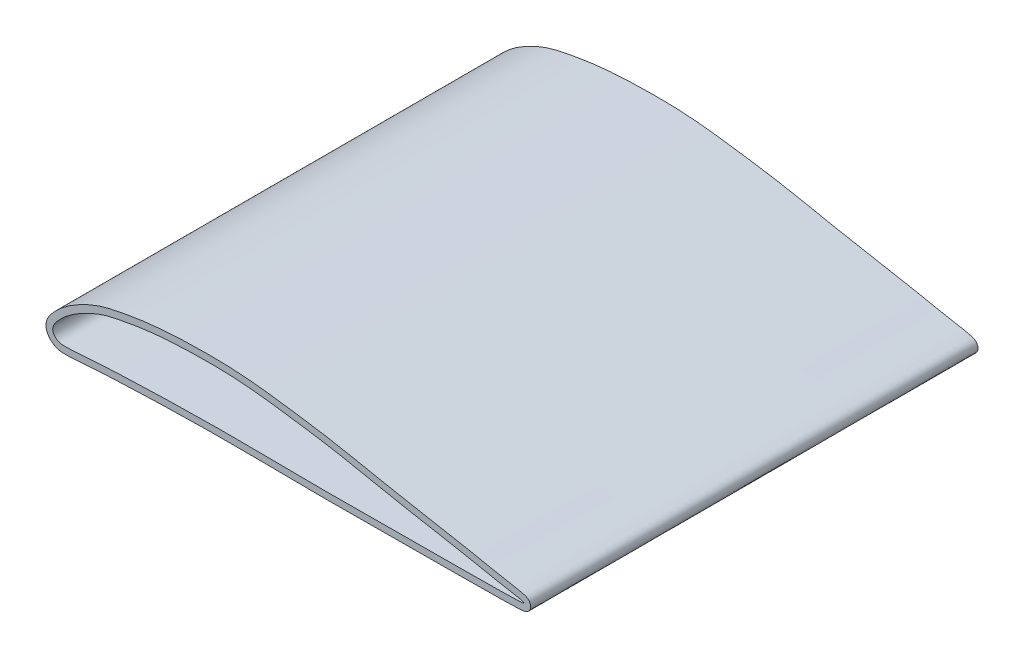
ISO-10303-21;
HEADER;
FILE_DESCRIPTION(('STEP AP214'),'2;1');
FILE_NAME('part.step','',(''),(''),'','','');
FILE_SCHEMA(('AUTOMOTIVE_DESIGN { 1 0 10303 214 1 1 1 1 }'));
ENDSEC;
DATA;
#1=APPLICATION_CONTEXT('core data for automotive mechanical design processes');
#2=APPLICATION_PROTOCOL_DEFINITION('international standard','automotive_design',2000,#1);
#3=PRODUCT_CONTEXT('',#1,'mechanical');
#4=PRODUCT('Part','Part','',(#3));
#5=PRODUCT_RELATED_PRODUCT_CATEGORY('part','',(#4));
#6=PRODUCT_DEFINITION_FORMATION('','',#4);
#7=PRODUCT_DEFINITION_CONTEXT('part definition',#1,'design');
#8=PRODUCT_DEFINITION('design','',#6,#7);
#9=PRODUCT_DEFINITION_SHAPE('','',#8);
#10=(LENGTH_UNIT() NAMED_UNIT(*) SI_UNIT(.MILLI.,.METRE.));
#11=(NAMED_UNIT(*) PLANE_ANGLE_UNIT() SI_UNIT($,.RADIAN.));
#12=(NAMED_UNIT(*) SI_UNIT($,.STERADIAN.) SOLID_ANGLE_UNIT());
#13=UNCERTAINTY_MEASURE_WITH_UNIT(LENGTH_MEASURE(1.E-05),#10,'distance_accuracy_value','');
#14=(GEOMETRIC_REPRESENTATION_CONTEXT(3) GLOBAL_UNCERTAINTY_ASSIGNED_CONTEXT((#13)) GLOBAL_UNIT_ASSIGNED_CONTEXT((#10,
#11,#12)) REPRESENTATION_CONTEXT('',''));
#15=CARTESIAN_POINT('',(0.,0.,0.));
#16=DIRECTION('',(0.,0.,1.));
#17=DIRECTION('',(1.,0.,0.));
#18=AXIS2_PLACEMENT_3D('',#15,#16,#17);
#19=CARTESIAN_POINT('',(-2.12770220526425,9.28546322944858,337.82));
#20=DIRECTION('',(0.,0.,-1.));
#21=DIRECTION('',(-1.,0.,0.));
#22=AXIS2_PLACEMENT_3D('',#19,#20,#21);
#23=PLANE('',#22);
#24=CARTESIAN_POINT('',(360.611783088414,-0.829716984691534,337.82));
#25=CARTESIAN_POINT('',(360.677516736931,-0.431769590755068,337.82));
#26=CARTESIAN_POINT('',(360.715012102294,0.39737776358076,337.82));
#27=CARTESIAN_POINT('',(360.421664380915,1.89734659052009,337.82));
#28=CARTESIAN_POINT('',(359.690517844514,3.17401205027613,337.82));
#29=CARTESIAN_POINT('',(358.918126768744,3.96508175282873,337.82));
#30=CARTESIAN_POINT('',(358.318267032827,4.42066290293129,337.82));
#31=CARTESIAN_POINT('',(357.843135950298,4.70927198930258,337.82));
#32=CARTESIAN_POINT('',(357.314769247348,4.98094514254315,337.82));
#33=CARTESIAN_POINT('',(356.769061674902,5.20760724953017,337.82));
#34=CARTESIAN_POINT('',(356.166361832082,5.41896649450408,337.82));
#35=CARTESIAN_POINT('',(355.564871973001,5.60295091670029,337.82));
#36=CARTESIAN_POINT('',(354.940172054753,5.77519661899665,337.82));
#37=CARTESIAN_POINT('',(354.062218077521,5.99777597210625,337.82));
#38=CARTESIAN_POINT('',(352.868144290553,6.27164418057462,337.82));
#39=CARTESIAN_POINT('',(351.281150812052,6.60345342509342,337.82));
#40=CARTESIAN_POINT('',(349.562200998619,6.93999659218324,337.82));
#41=CARTESIAN_POINT('',(347.7407484887,7.2805028361551,337.82));
#42=CARTESIAN_POINT('',(345.849846535147,7.62302316120932,337.82));
#43=CARTESIAN_POINT('',(343.284754246802,8.07888802212605,337.82));
#44=CARTESIAN_POINT('',(340.077278886889,8.64115010600491,337.82));
#45=CARTESIAN_POINT('',(336.581931789645,9.27338582575616,337.82));
#46=CARTESIAN_POINT('',(332.422020488974,10.0640645410946,337.82));
#47=CARTESIAN_POINT('',(327.903122178561,10.9777528968965,337.82));
#48=CARTESIAN_POINT('',(322.976471656021,12.0169837915886,337.82));
#49=CARTESIAN_POINT('',(317.864518336372,13.0643737721078,337.82));
#50=CARTESIAN_POINT('',(312.471448603847,14.1199230530068,337.82));
#51=CARTESIAN_POINT('',(306.892602428793,15.1792404595878,337.82));
#52=CARTESIAN_POINT('',(299.271359613369,16.5928128056946,337.82));
#53=CARTESIAN_POINT('',(289.539235870043,18.3555767649719,337.82));
#54=CARTESIAN_POINT('',(278.069145873182,20.4269138910801,337.82));
#55=CARTESIAN_POINT('',(266.889028325214,22.4813885575546,337.82));
#56=CARTESIAN_POINT('',(255.836169363417,24.5743857296795,337.82));
#57=CARTESIAN_POINT('',(241.119161142244,27.5041516765873,337.82));
#58=CARTESIAN_POINT('',(226.17771818306,30.6284955585057,337.82));
#59=CARTESIAN_POINT('',(211.073246752962,33.4503768288242,337.82));
#60=CARTESIAN_POINT('',(195.957402496639,35.9498185763177,337.82));
#61=CARTESIAN_POINT('',(177.127921344669,38.6597453231217,337.82));
#62=CARTESIAN_POINT('',(158.171643384304,41.2095808677918,337.82));
#63=CARTESIAN_POINT('',(142.799977726278,42.6172304733267,337.82));
#64=CARTESIAN_POINT('',(127.3617538442,43.4085128169304,337.82));
#65=CARTESIAN_POINT('',(111.9803158707,43.4046138855933,337.82));
#66=CARTESIAN_POINT('',(96.6348267084863,42.956517857911,337.82));
#67=CARTESIAN_POINT('',(85.0848707586515,42.3205909914167,337.82));
#68=CARTESIAN_POINT('',(73.531301514642,41.2765470192465,337.82));
#69=CARTESIAN_POINT('',(63.9313400403143,39.958908520291,337.82));
#70=CARTESIAN_POINT('',(56.3171155845465,38.6791030971168,337.82));
#71=CARTESIAN_POINT('',(50.6499497599874,37.6425202662996,337.82));
#72=CARTESIAN_POINT('',(44.9021633114431,36.4945120368245,337.82));
#73=CARTESIAN_POINT('',(39.1082915605699,35.0915992380378,337.82));
#74=CARTESIAN_POINT('',(33.2849324709737,33.2881291630142,337.82));
#75=CARTESIAN_POINT('',(27.6295600534796,30.9904600469647,337.82));
#76=CARTESIAN_POINT('',(22.2804118646765,28.4439820560217,337.82));
#77=CARTESIAN_POINT('',(17.0046326392783,25.6141861462535,337.82));
#78=CARTESIAN_POINT('',(11.8148958602526,22.3569422918749,337.82));
#79=CARTESIAN_POINT('',(7.67976623012431,19.2848085907363,337.82));
#80=CARTESIAN_POINT('',(4.59692601950477,16.635405025183,337.82));
#81=CARTESIAN_POINT('',(2.75896588536493,14.8760894966245,337.82));
#82=CARTESIAN_POINT('',(1.29550753139356,13.3542887541975,337.82));
#83=CARTESIAN_POINT('',(-0.163888759750838,11.7621121392498,337.82));
#84=CARTESIAN_POINT('',(-1.76422697415687,9.87346266874208,337.82));
#85=CARTESIAN_POINT('',(-3.25473722108047,7.6373019832347,337.82));
#86=CARTESIAN_POINT('',(-4.24628459349043,5.73495661624964,337.82));
#87=CARTESIAN_POINT('',(-5.00239928749968,3.53636937217703,337.82));
#88=CARTESIAN_POINT('',(-5.26736052713064,1.40326338643544,337.82));
#89=CARTESIAN_POINT('',(-5.12293710295604,-0.423499273381427,337.82));
#90=CARTESIAN_POINT('',(-4.69457004507471,-2.28179932337742,337.82));
#91=CARTESIAN_POINT('',(-3.75857745264617,-4.27625739479231,337.82));
#92=CARTESIAN_POINT('',(-2.25734351985861,-6.25985534644904,337.82));
#93=CARTESIAN_POINT('',(-0.464391315841216,-7.89542098064643,337.82));
#94=CARTESIAN_POINT('',(1.57959188809487,-9.2065616818801,337.82));
#95=CARTESIAN_POINT('',(3.94550239027525,-10.1218160695568,337.82));
#96=CARTESIAN_POINT('',(6.09493637855499,-10.5121842637663,337.82));
#97=CARTESIAN_POINT('',(7.97730648609706,-10.635362611475,337.82));
#98=CARTESIAN_POINT('',(9.51378006784479,-10.6559856217739,337.82));
#99=CARTESIAN_POINT('',(11.0416365883093,-10.6551970821441,337.82));
#100=CARTESIAN_POINT('',(12.5521230776529,-10.6243070079716,337.82));
#101=CARTESIAN_POINT('',(14.5465880708117,-10.5534600115824,337.82));
#102=CARTESIAN_POINT('',(17.0027877836702,-10.4174453262564,337.82));
#103=CARTESIAN_POINT('',(19.8949796055631,-10.2135180018431,337.82));
#104=CARTESIAN_POINT('',(22.7646933158898,-9.98881693717707,337.82));
#105=CARTESIAN_POINT('',(26.5530442008788,-9.67955193951272,337.82));
#106=CARTESIAN_POINT('',(31.2339877004447,-9.32155039401743,337.82));
#107=CARTESIAN_POINT('',(36.8687596815271,-8.95415187691269,337.82));
#108=CARTESIAN_POINT('',(42.5127093096359,-8.64234179615913,337.82));
#109=CARTESIAN_POINT('',(50.0612723083799,-8.28265032401868,337.82));
#110=CARTESIAN_POINT('',(59.5358879153629,-7.89049896565152,337.82));
#111=CARTESIAN_POINT('',(70.8921113057371,-7.47157703221145,337.82));
#112=CARTESIAN_POINT('',(82.2509482839475,-7.13095886237088,337.82));
#113=CARTESIAN_POINT('',(93.6164314430209,-6.85714543292889,337.82));
#114=CARTESIAN_POINT('',(108.778159596147,-6.57307460139264,337.82));
#115=CARTESIAN_POINT('',(127.732040417636,-6.33343496888481,337.82));
#116=CARTESIAN_POINT('',(150.425871859691,-6.39021215201501,337.82));
#117=CARTESIAN_POINT('',(173.21538765855,-6.75511670445447,337.82));
#118=CARTESIAN_POINT('',(196.045006315125,-6.93306279481234,337.82));
#119=CARTESIAN_POINT('',(218.881556020523,-6.93455837706369,337.82));
#120=CARTESIAN_POINT('',(237.963138188414,-6.84933351263652,337.82));
#121=CARTESIAN_POINT('',(253.08865728164,-6.71588183253142,337.82));
#122=CARTESIAN_POINT('',(264.367699993041,-6.59380460984213,337.82));
#123=CARTESIAN_POINT('',(275.720835372521,-6.48324674649998,337.82));
#124=CARTESIAN_POINT('',(287.295269893329,-6.41882566901398,337.82));
#125=CARTESIAN_POINT('',(297.162605658105,-6.41490960033031,337.82));
#126=CARTESIAN_POINT('',(304.922637869046,-6.40961902290395,337.82));
#127=CARTESIAN_POINT('',(310.619329753822,-6.39832852705022,337.82));
#128=CARTESIAN_POINT('',(316.140036270488,-6.37283305119357,337.82));
#129=CARTESIAN_POINT('',(321.398875956308,-6.32522505234369,337.82));
#130=CARTESIAN_POINT('',(326.448157730941,-6.2523331854654,337.82));
#131=CARTESIAN_POINT('',(331.035810080153,-6.18102850517306,337.82));
#132=CARTESIAN_POINT('',(335.22924779922,-6.12209407239269,337.82));
#133=CARTESIAN_POINT('',(338.726576785923,-6.07929615723084,337.82));
#134=CARTESIAN_POINT('',(342.605005677611,-6.03456860350175,337.82));
#135=CARTESIAN_POINT('',(345.867985865657,-5.97808396861637,337.82));
#136=CARTESIAN_POINT('',(348.354442671524,-5.91154090397633,337.82));
#137=CARTESIAN_POINT('',(350.122477671704,-5.8481026150487,337.82));
#138=CARTESIAN_POINT('',(351.763294974037,-5.767835834691,337.82));
#139=CARTESIAN_POINT('',(353.004865599127,-5.68325262398628,337.82));
#140=CARTESIAN_POINT('',(353.921088246468,-5.60050055122703,337.82));
#141=CARTESIAN_POINT('',(354.574012682801,-5.52847541831667,337.82));
#142=CARTESIAN_POINT('',(355.202262978684,-5.44239094592311,337.82));
#143=CARTESIAN_POINT('',(355.828436834357,-5.332491735066,337.82));
#144=CARTESIAN_POINT('',(356.387775071361,-5.20377185545108,337.82));
#145=CARTESIAN_POINT('',(356.91995574755,-5.04018073079652,337.82));
#146=CARTESIAN_POINT('',(357.393568000975,-4.86125929213146,337.82));
#147=CARTESIAN_POINT('',(357.991793491798,-4.57238551329047,337.82));
#148=CARTESIAN_POINT('',(358.783473470334,-4.05555403862709,337.82));
#149=CARTESIAN_POINT('',(359.660685696218,-3.18342196269986,337.82));
#150=CARTESIAN_POINT('',(360.32061021119,-1.99030660003803,337.82));
#151=CARTESIAN_POINT('',(360.546049439897,-1.22766437862788,337.82));
#152=CARTESIAN_POINT('',(360.611783088414,-0.829716984691534,337.82));
#153=B_SPLINE_CURVE_WITH_KNOTS('',3,(#24,#25,#26,#27,#28,#29,#30,#31,#32,#33,#34,#35,#36,#37,
#38,#39,#40,#41,#42,#43,#44,#45,#46,#47,#48,#49,#50,#51,#52,#53,#54,#55,#56,#57,#58,#59,#60,#61,
#62,#63,#64,#65,#66,#67,#68,#69,#70,#71,#72,#73,#74,#75,#76,#77,#78,#79,#80,#81,#82,#83,#84,#85,
#86,#87,#88,#89,#90,#91,#92,#93,#94,#95,#96,#97,#98,#99,#100,#101,#102,#103,#104,#105,#106,#107,
#108,#109,#110,#111,#112,#113,#114,#115,#116,#117,#118,#119,#120,#121,#122,#123,#124,#125,#126,
#127,#128,#129,#130,#131,#132,#133,#134,#135,#136,#137,#138,#139,#140,#141,#142,#143,#144,#145,
#146,#147,#148,#149,#150,#151,#152),.UNSPECIFIED.,.T.,.F.,(4,1,1,1,1,1,1,1,1,1,1,1,1,1,1,1,1,1,
1,1,1,1,1,1,1,1,1,1,1,1,1,1,1,1,1,1,1,1,1,1,1,1,1,1,1,1,1,1,1,1,1,1,1,1,1,1,1,1,1,1,1,1,1,1,1,1,
1,1,1,1,1,1,1,1,1,1,1,1,1,1,1,1,1,1,1,1,1,1,1,1,1,1,1,1,1,1,1,1,1,1,1,1,1,1,1,1,1,1,1,1,1,1,1,1,
1,1,1,1,1,1,1,1,1,1,1,1,4),(0.,0.000244140625,0.00048828125,0.0009765625,0.00146484375,
0.001953125,0.00244140625,0.0029296875,0.00390625,0.0048828125,0.005859375,0.0068359375,
0.0078125,0.009765625,0.01171875,0.013671875,0.015625,0.017578125,0.01953125,0.0234375,
0.02734375,0.03125,0.0390625,0.046875,0.0546875,0.0625,0.0703125,0.078125,0.09375,0.109375,
0.125,0.140625,0.15625,0.1875,0.203125,0.21875,0.25,0.28125,0.296875,0.3125,0.34375,0.359375,
0.375,0.390625,0.40625,0.4140625,0.421875,0.4296875,0.4375,0.4453125,0.453125,0.4609375,0.46875,
0.4765625,0.484375,0.48828125,0.4921875,0.494140625,0.49609375,0.5,0.501953125,0.50390625,
0.505859375,0.5078125,0.5087890625,0.509765625,0.51171875,0.513671875,0.515625,0.517578125,
0.51953125,0.521484375,0.5234375,0.525390625,0.52734375,0.529296875,0.53125,0.53515625,
0.5390625,0.54296875,0.546875,0.5546875,0.5625,0.5703125,0.578125,0.59375,0.609375,0.625,
0.640625,0.65625,0.6875,0.71875,0.75,0.78125,0.8125,0.84375,0.859375,0.875,0.890625,0.90625,
0.921875,0.9296875,0.9375,0.9453125,0.953125,0.9609375,0.96875,0.97265625,0.9765625,0.98046875,
0.984375,0.986328125,0.98828125,0.990234375,0.9921875,0.9931640625,0.994140625,0.9951171875,
0.99609375,0.9970703125,0.99755859375,0.998046875,0.99853515625,0.9990234375,0.99951171875,
0.999755859375,1.),.UNSPECIFIED.);
#154=CARTESIAN_POINT('',(360.611783088414,-0.829716984691534,337.82));
#155=VERTEX_POINT('',#154);
#156=EDGE_CURVE('E10',#155,#155,#153,.T.);
#157=ORIENTED_EDGE('',*,*,#156,.T.);
#158=EDGE_LOOP('',(#157));
#159=FACE_BOUND('',#158,.T.);
#160=CARTESIAN_POINT('',(355.6,0.,337.82));
#161=CARTESIAN_POINT('',(355.742662775557,0.861733457404024,337.82));
#162=CARTESIAN_POINT('',(335.067988759287,4.17789949988638,337.82));
#163=CARTESIAN_POINT('',(315.595899257123,8.51230052219543,337.82));
#164=CARTESIAN_POINT('',(283.755747478346,14.2150367655207,337.82));
#165=CARTESIAN_POINT('',(248.711891199437,20.6228502405481,337.82));
#166=CARTESIAN_POINT('',(213.099276813296,28.2960869760028,337.82));
#167=CARTESIAN_POINT('',(177.438860413867,33.5332802947491,337.82));
#168=CARTESIAN_POINT('',(141.86037480944,38.2674574653902,337.82));
#169=CARTESIAN_POINT('',(106.137977514781,38.4811659569359,337.82));
#170=CARTESIAN_POINT('',(76.3937240224355,36.903717850132,337.82));
#171=CARTESIAN_POINT('',(52.783057717719,32.9870860259043,337.82));
#172=CARTESIAN_POINT('',(37.7504416231908,29.8496160738291,337.82));
#173=CARTESIAN_POINT('',(26.1236794290295,24.7708508540007,337.82));
#174=CARTESIAN_POINT('',(17.1735407653483,19.9778051550387,337.82));
#175=CARTESIAN_POINT('',(9.67476995848276,14.5696321439262,337.82));
#176=CARTESIAN_POINT('',(3.4981725269177,8.49989483290762,337.82));
#177=CARTESIAN_POINT('',(-2.45147525088026,0.924296965716232,337.82));
#178=CARTESIAN_POINT('',(3.71206904824317,-5.34774951366373,337.82));
#179=CARTESIAN_POINT('',(10.4481354150685,-5.69217651558586,337.82));
#180=CARTESIAN_POINT('',(17.8595889965748,-5.314856424308,337.82));
#181=CARTESIAN_POINT('',(26.731491993828,-4.54928674538662,337.82));
#182=CARTESIAN_POINT('',(38.5676489300482,-3.71930596781918,337.82));
#183=CARTESIAN_POINT('',(53.3791209290981,-3.04398558245633,337.82));
#184=CARTESIAN_POINT('',(77.0722217050704,-2.13517549792576,337.82));
#185=CARTESIAN_POINT('',(106.69983098119,-1.46254157265574,337.82));
#186=CARTESIAN_POINT('',(142.260047782208,-1.1400189001601,337.82));
#187=CARTESIAN_POINT('',(177.831006446058,-1.78643895035578,337.82));
#188=CARTESIAN_POINT('',(213.348366865824,-1.8913487932747,337.82));
#189=CARTESIAN_POINT('',(249.080086592797,-1.72155060470322,337.82));
#190=CARTESIAN_POINT('',(283.988321231519,-1.25047218855206,337.82));
#191=CARTESIAN_POINT('',(315.634817831284,-1.39747633599044,337.82));
#192=CARTESIAN_POINT('',(335.235128281306,-1.00019432783944,337.82));
#193=CARTESIAN_POINT('',(355.460930634132,-0.840027996094049,337.82));
#194=CARTESIAN_POINT('',(355.6,0.,337.82));
#195=B_SPLINE_CURVE_WITH_KNOTS('',3,(#160,#161,#162,#163,#164,#165,#166,#167,#168,#169,#170,
#171,#172,#173,#174,#175,#176,#177,#178,#179,#180,#181,#182,#183,#184,#185,#186,#187,#188,#189,
#190,#191,#192,#193,#194),.UNSPECIFIED.,.T.,.F.,(4,1,1,1,1,1,1,1,1,1,1,1,1,1,1,1,1,1,1,1,1,1,1,
1,1,1,1,1,1,1,1,1,4),(0.,0.025026287291907,0.0499520617534605,0.0996838098417098,
0.149415557929959,0.199258543548913,0.248703056455884,0.297849082099681,0.346623035466671,
0.395438522152419,0.420070941928227,0.445103861606754,0.458263471856863,0.472049530181497,
0.487005631683779,0.495455170409994,0.509298808795639,0.518413363916536,0.524589236670762,
0.536779457562765,0.548989568108669,0.561192853063547,0.585584554925768,0.60996344954126,
0.658714952490805,0.707463407069837,0.75622836274545,0.804980995286651,0.853733783102001,
0.902478123236492,0.951230530787744,0.975604078287936,1.),.UNSPECIFIED.);
#196=CARTESIAN_POINT('',(355.6,0.,337.82));
#197=VERTEX_POINT('',#196);
#198=EDGE_CURVE('E45',#197,#197,#195,.T.);
#199=ORIENTED_EDGE('',*,*,#198,.F.);
#200=EDGE_LOOP('',(#199));
#201=FACE_BOUND('',#200,.T.);
#202=ADVANCED_FACE('F32',(#159,#201),#23,.F.);
#203=CARTESIAN_POINT('',(-2.12770220526425,9.28546322944858,0.));
#204=DIRECTION('',(0.,0.,-1.));
#205=DIRECTION('',(-1.,0.,0.));
#206=AXIS2_PLACEMENT_3D('',#203,#204,#205);
#207=PLANE('',#206);
#208=CARTESIAN_POINT('',(360.611783088414,-0.829716984691534,0.));
#209=CARTESIAN_POINT('',(360.677516736931,-0.431769590755068,0.));
#210=CARTESIAN_POINT('',(360.715012102294,0.39737776358076,0.));
#211=CARTESIAN_POINT('',(360.421664380915,1.89734659052009,0.));
#212=CARTESIAN_POINT('',(359.690517844514,3.17401205027613,0.));
#213=CARTESIAN_POINT('',(358.918126768744,3.96508175282873,0.));
#214=CARTESIAN_POINT('',(358.318267032827,4.42066290293129,0.));
#215=CARTESIAN_POINT('',(357.843135950298,4.70927198930258,0.));
#216=CARTESIAN_POINT('',(357.314769247348,4.98094514254315,0.));
#217=CARTESIAN_POINT('',(356.769061674902,5.20760724953017,0.));
#218=CARTESIAN_POINT('',(356.166361832082,5.41896649450408,0.));
#219=CARTESIAN_POINT('',(355.564871973001,5.60295091670029,0.));
#220=CARTESIAN_POINT('',(354.940172054753,5.77519661899665,0.));
#221=CARTESIAN_POINT('',(354.062218077521,5.99777597210625,0.));
#222=CARTESIAN_POINT('',(352.868144290553,6.27164418057462,0.));
#223=CARTESIAN_POINT('',(351.281150812052,6.60345342509342,0.));
#224=CARTESIAN_POINT('',(349.562200998619,6.93999659218324,0.));
#225=CARTESIAN_POINT('',(347.7407484887,7.2805028361551,0.));
#226=CARTESIAN_POINT('',(345.849846535147,7.62302316120932,0.));
#227=CARTESIAN_POINT('',(343.284754246802,8.07888802212605,0.));
#228=CARTESIAN_POINT('',(340.077278886889,8.64115010600491,0.));
#229=CARTESIAN_POINT('',(336.581931789645,9.27338582575616,0.));
#230=CARTESIAN_POINT('',(332.422020488974,10.0640645410946,0.));
#231=CARTESIAN_POINT('',(327.903122178561,10.9777528968965,0.));
#232=CARTESIAN_POINT('',(322.976471656021,12.0169837915886,0.));
#233=CARTESIAN_POINT('',(317.864518336372,13.0643737721078,0.));
#234=CARTESIAN_POINT('',(312.471448603847,14.1199230530068,0.));
#235=CARTESIAN_POINT('',(306.892602428793,15.1792404595878,0.));
#236=CARTESIAN_POINT('',(299.271359613369,16.5928128056946,0.));
#237=CARTESIAN_POINT('',(289.539235870043,18.3555767649719,0.));
#238=CARTESIAN_POINT('',(278.069145873182,20.4269138910801,0.));
#239=CARTESIAN_POINT('',(266.889028325214,22.4813885575546,0.));
#240=CARTESIAN_POINT('',(255.836169363417,24.5743857296795,0.));
#241=CARTESIAN_POINT('',(241.119161142244,27.5041516765873,0.));
#242=CARTESIAN_POINT('',(226.17771818306,30.6284955585057,0.));
#243=CARTESIAN_POINT('',(211.073246752962,33.4503768288242,0.));
#244=CARTESIAN_POINT('',(195.957402496639,35.9498185763177,0.));
#245=CARTESIAN_POINT('',(177.127921344669,38.6597453231217,0.));
#246=CARTESIAN_POINT('',(158.171643384304,41.2095808677918,0.));
#247=CARTESIAN_POINT('',(142.799977726278,42.6172304733267,0.));
#248=CARTESIAN_POINT('',(127.3617538442,43.4085128169304,0.));
#249=CARTESIAN_POINT('',(111.9803158707,43.4046138855933,0.));
#250=CARTESIAN_POINT('',(96.6348267084863,42.956517857911,0.));
#251=CARTESIAN_POINT('',(85.0848707586515,42.3205909914167,0.));
#252=CARTESIAN_POINT('',(73.531301514642,41.2765470192465,0.));
#253=CARTESIAN_POINT('',(63.9313400403143,39.958908520291,0.));
#254=CARTESIAN_POINT('',(56.3171155845465,38.6791030971168,0.));
#255=CARTESIAN_POINT('',(50.6499497599874,37.6425202662996,0.));
#256=CARTESIAN_POINT('',(44.9021633114431,36.4945120368245,0.));
#257=CARTESIAN_POINT('',(39.1082915605699,35.0915992380378,0.));
#258=CARTESIAN_POINT('',(33.2849324709737,33.2881291630142,0.));
#259=CARTESIAN_POINT('',(27.6295600534796,30.9904600469647,0.));
#260=CARTESIAN_POINT('',(22.2804118646765,28.4439820560217,0.));
#261=CARTESIAN_POINT('',(17.0046326392783,25.6141861462535,0.));
#262=CARTESIAN_POINT('',(11.8148958602526,22.3569422918749,0.));
#263=CARTESIAN_POINT('',(7.67976623012431,19.2848085907363,0.));
#264=CARTESIAN_POINT('',(4.59692601950477,16.635405025183,0.));
#265=CARTESIAN_POINT('',(2.75896588536493,14.8760894966245,0.));
#266=CARTESIAN_POINT('',(1.29550753139356,13.3542887541975,0.));
#267=CARTESIAN_POINT('',(-0.163888759750838,11.7621121392498,0.));
#268=CARTESIAN_POINT('',(-1.76422697415687,9.87346266874208,0.));
#269=CARTESIAN_POINT('',(-3.25473722108047,7.6373019832347,0.));
#270=CARTESIAN_POINT('',(-4.24628459349043,5.73495661624964,0.));
#271=CARTESIAN_POINT('',(-5.00239928749968,3.53636937217703,0.));
#272=CARTESIAN_POINT('',(-5.26736052713064,1.40326338643544,0.));
#273=CARTESIAN_POINT('',(-5.12293710295604,-0.423499273381427,0.));
#274=CARTESIAN_POINT('',(-4.69457004507471,-2.28179932337742,0.));
#275=CARTESIAN_POINT('',(-3.75857745264617,-4.27625739479231,0.));
#276=CARTESIAN_POINT('',(-2.25734351985861,-6.25985534644904,0.));
#277=CARTESIAN_POINT('',(-0.464391315841216,-7.89542098064643,0.));
#278=CARTESIAN_POINT('',(1.57959188809487,-9.2065616818801,0.));
#279=CARTESIAN_POINT('',(3.94550239027525,-10.1218160695568,0.));
#280=CARTESIAN_POINT('',(6.09493637855499,-10.5121842637663,0.));
#281=CARTESIAN_POINT('',(7.97730648609706,-10.635362611475,0.));
#282=CARTESIAN_POINT('',(9.51378006784479,-10.6559856217739,0.));
#283=CARTESIAN_POINT('',(11.0416365883093,-10.6551970821441,0.));
#284=CARTESIAN_POINT('',(12.5521230776529,-10.6243070079716,0.));
#285=CARTESIAN_POINT('',(14.5465880708117,-10.5534600115824,0.));
#286=CARTESIAN_POINT('',(17.0027877836702,-10.4174453262564,0.));
#287=CARTESIAN_POINT('',(19.8949796055631,-10.2135180018431,0.));
#288=CARTESIAN_POINT('',(22.7646933158898,-9.98881693717707,0.));
#289=CARTESIAN_POINT('',(26.5530442008788,-9.67955193951272,0.));
#290=CARTESIAN_POINT('',(31.2339877004447,-9.32155039401743,0.));
#291=CARTESIAN_POINT('',(36.8687596815271,-8.95415187691269,0.));
#292=CARTESIAN_POINT('',(42.5127093096359,-8.64234179615913,0.));
#293=CARTESIAN_POINT('',(50.0612723083799,-8.28265032401868,0.));
#294=CARTESIAN_POINT('',(59.5358879153629,-7.89049896565152,0.));
#295=CARTESIAN_POINT('',(70.8921113057371,-7.47157703221145,0.));
#296=CARTESIAN_POINT('',(82.2509482839475,-7.13095886237088,0.));
#297=CARTESIAN_POINT('',(93.6164314430209,-6.85714543292889,0.));
#298=CARTESIAN_POINT('',(108.778159596147,-6.57307460139264,0.));
#299=CARTESIAN_POINT('',(127.732040417636,-6.33343496888481,0.));
#300=CARTESIAN_POINT('',(150.425871859691,-6.39021215201501,0.));
#301=CARTESIAN_POINT('',(173.21538765855,-6.75511670445447,0.));
#302=CARTESIAN_POINT('',(196.045006315125,-6.93306279481234,0.));
#303=CARTESIAN_POINT('',(218.881556020523,-6.93455837706369,0.));
#304=CARTESIAN_POINT('',(237.963138188414,-6.84933351263652,0.));
#305=CARTESIAN_POINT('',(253.08865728164,-6.71588183253142,0.));
#306=CARTESIAN_POINT('',(264.367699993041,-6.59380460984213,0.));
#307=CARTESIAN_POINT('',(275.720835372521,-6.48324674649998,0.));
#308=CARTESIAN_POINT('',(287.295269893329,-6.41882566901398,0.));
#309=CARTESIAN_POINT('',(297.162605658105,-6.41490960033031,0.));
#310=CARTESIAN_POINT('',(304.922637869046,-6.40961902290395,0.));
#311=CARTESIAN_POINT('',(310.619329753822,-6.39832852705022,0.));
#312=CARTESIAN_POINT('',(316.140036270488,-6.37283305119357,0.));
#313=CARTESIAN_POINT('',(321.398875956308,-6.32522505234369,0.));
#314=CARTESIAN_POINT('',(326.448157730941,-6.2523331854654,0.));
#315=CARTESIAN_POINT('',(331.035810080153,-6.18102850517306,0.));
#316=CARTESIAN_POINT('',(335.22924779922,-6.12209407239269,0.));
#317=CARTESIAN_POINT('',(338.726576785923,-6.07929615723084,0.));
#318=CARTESIAN_POINT('',(342.605005677611,-6.03456860350175,0.));
#319=CARTESIAN_POINT('',(345.867985865657,-5.97808396861637,0.));
#320=CARTESIAN_POINT('',(348.354442671524,-5.91154090397633,0.));
#321=CARTESIAN_POINT('',(350.122477671704,-5.8481026150487,0.));
#322=CARTESIAN_POINT('',(351.763294974037,-5.767835834691,0.));
#323=CARTESIAN_POINT('',(353.004865599127,-5.68325262398628,0.));
#324=CARTESIAN_POINT('',(353.921088246468,-5.60050055122703,0.));
#325=CARTESIAN_POINT('',(354.574012682801,-5.52847541831667,0.));
#326=CARTESIAN_POINT('',(355.202262978684,-5.44239094592311,0.));
#327=CARTESIAN_POINT('',(355.828436834357,-5.332491735066,0.));
#328=CARTESIAN_POINT('',(356.387775071361,-5.20377185545108,0.));
#329=CARTESIAN_POINT('',(356.91995574755,-5.04018073079652,0.));
#330=CARTESIAN_POINT('',(357.393568000975,-4.86125929213146,0.));
#331=CARTESIAN_POINT('',(357.991793491798,-4.57238551329047,0.));
#332=CARTESIAN_POINT('',(358.783473470334,-4.05555403862709,0.));
#333=CARTESIAN_POINT('',(359.660685696218,-3.18342196269986,0.));
#334=CARTESIAN_POINT('',(360.32061021119,-1.99030660003803,0.));
#335=CARTESIAN_POINT('',(360.546049439897,-1.22766437862788,0.));
#336=CARTESIAN_POINT('',(360.611783088414,-0.829716984691534,0.));
#337=B_SPLINE_CURVE_WITH_KNOTS('',3,(#208,#209,#210,#211,#212,#213,#214,#215,#216,#217,#218,
#219,#220,#221,#222,#223,#224,#225,#226,#227,#228,#229,#230,#231,#232,#233,#234,#235,#236,#237,
#238,#239,#240,#241,#242,#243,#244,#245,#246,#247,#248,#249,#250,#251,#252,#253,#254,#255,#256,
#257,#258,#259,#260,#261,#262,#263,#264,#265,#266,#267,#268,#269,#270,#271,#272,#273,#274,#275,
#276,#277,#278,#279,#280,#281,#282,#283,#284,#285,#286,#287,#288,#289,#290,#291,#292,#293,#294,
#295,#296,#297,#298,#299,#300,#301,#302,#303,#304,#305,#306,#307,#308,#309,#310,#311,#312,#313,
#314,#315,#316,#317,#318,#319,#320,#321,#322,#323,#324,#325,#326,#327,#328,#329,#330,#331,#332,
#333,#334,#335,#336),.UNSPECIFIED.,.T.,.F.,(4,1,1,1,1,1,1,1,1,1,1,1,1,1,1,1,1,1,1,1,1,1,1,1,1,1,
1,1,1,1,1,1,1,1,1,1,1,1,1,1,1,1,1,1,1,1,1,1,1,1,1,1,1,1,1,1,1,1,1,1,1,1,1,1,1,1,1,1,1,1,1,1,1,1,
1,1,1,1,1,1,1,1,1,1,1,1,1,1,1,1,1,1,1,1,1,1,1,1,1,1,1,1,1,1,1,1,1,1,1,1,1,1,1,1,1,1,1,1,1,1,1,1,
1,1,1,1,4),(0.,0.000244140625,0.00048828125,0.0009765625,0.00146484375,0.001953125,
0.00244140625,0.0029296875,0.00390625,0.0048828125,0.005859375,0.0068359375,0.0078125,
0.009765625,0.01171875,0.013671875,0.015625,0.017578125,0.01953125,0.0234375,0.02734375,0.03125,
0.0390625,0.046875,0.0546875,0.0625,0.0703125,0.078125,0.09375,0.109375,0.125,0.140625,0.15625,
0.1875,0.203125,0.21875,0.25,0.28125,0.296875,0.3125,0.34375,0.359375,0.375,0.390625,0.40625,
0.4140625,0.421875,0.4296875,0.4375,0.4453125,0.453125,0.4609375,0.46875,0.4765625,0.484375,
0.48828125,0.4921875,0.494140625,0.49609375,0.5,0.501953125,0.50390625,0.505859375,0.5078125,
0.5087890625,0.509765625,0.51171875,0.513671875,0.515625,0.517578125,0.51953125,0.521484375,
0.5234375,0.525390625,0.52734375,0.529296875,0.53125,0.53515625,0.5390625,0.54296875,0.546875,
0.5546875,0.5625,0.5703125,0.578125,0.59375,0.609375,0.625,0.640625,0.65625,0.6875,0.71875,0.75,
0.78125,0.8125,0.84375,0.859375,0.875,0.890625,0.90625,0.921875,0.9296875,0.9375,0.9453125,
0.953125,0.9609375,0.96875,0.97265625,0.9765625,0.98046875,0.984375,0.986328125,0.98828125,
0.990234375,0.9921875,0.9931640625,0.994140625,0.9951171875,0.99609375,0.9970703125,
0.99755859375,0.998046875,0.99853515625,0.9990234375,0.99951171875,0.999755859375,1.),.UNSPECIFIED.);
#338=CARTESIAN_POINT('',(360.611783088414,-0.829716984691534,0.));
#339=VERTEX_POINT('',#338);
#340=EDGE_CURVE('E37',#339,#339,#337,.T.);
#341=ORIENTED_EDGE('',*,*,#340,.F.);
#342=EDGE_LOOP('',(#341));
#343=FACE_BOUND('',#342,.T.);
#344=CARTESIAN_POINT('',(355.6,0.,0.));
#345=CARTESIAN_POINT('',(355.742662775557,0.861733457404024,0.));
#346=CARTESIAN_POINT('',(335.067988759287,4.17789949988638,0.));
#347=CARTESIAN_POINT('',(315.595899257123,8.51230052219543,0.));
#348=CARTESIAN_POINT('',(283.755747478346,14.2150367655207,0.));
#349=CARTESIAN_POINT('',(248.711891199437,20.6228502405481,0.));
#350=CARTESIAN_POINT('',(213.099276813296,28.2960869760028,0.));
#351=CARTESIAN_POINT('',(177.438860413867,33.5332802947491,0.));
#352=CARTESIAN_POINT('',(141.86037480944,38.2674574653902,0.));
#353=CARTESIAN_POINT('',(106.137977514781,38.4811659569359,0.));
#354=CARTESIAN_POINT('',(76.3937240224355,36.903717850132,0.));
#355=CARTESIAN_POINT('',(52.783057717719,32.9870860259043,0.));
#356=CARTESIAN_POINT('',(37.7504416231908,29.8496160738291,0.));
#357=CARTESIAN_POINT('',(26.1236794290295,24.7708508540007,0.));
#358=CARTESIAN_POINT('',(17.1735407653483,19.9778051550387,0.));
#359=CARTESIAN_POINT('',(9.67476995848276,14.5696321439262,0.));
#360=CARTESIAN_POINT('',(3.4981725269177,8.49989483290762,0.));
#361=CARTESIAN_POINT('',(-2.45147525088026,0.924296965716232,0.));
#362=CARTESIAN_POINT('',(3.71206904824317,-5.34774951366373,0.));
#363=CARTESIAN_POINT('',(10.4481354150685,-5.69217651558586,0.));
#364=CARTESIAN_POINT('',(17.8595889965748,-5.314856424308,0.));
#365=CARTESIAN_POINT('',(26.731491993828,-4.54928674538662,0.));
#366=CARTESIAN_POINT('',(38.5676489300482,-3.71930596781918,0.));
#367=CARTESIAN_POINT('',(53.3791209290981,-3.04398558245633,0.));
#368=CARTESIAN_POINT('',(77.0722217050704,-2.13517549792576,0.));
#369=CARTESIAN_POINT('',(106.69983098119,-1.46254157265574,0.));
#370=CARTESIAN_POINT('',(142.260047782208,-1.1400189001601,0.));
#371=CARTESIAN_POINT('',(177.831006446058,-1.78643895035578,0.));
#372=CARTESIAN_POINT('',(213.348366865824,-1.8913487932747,0.));
#373=CARTESIAN_POINT('',(249.080086592797,-1.72155060470322,0.));
#374=CARTESIAN_POINT('',(283.988321231519,-1.25047218855206,0.));
#375=CARTESIAN_POINT('',(315.634817831284,-1.39747633599044,0.));
#376=CARTESIAN_POINT('',(335.235128281306,-1.00019432783944,0.));
#377=CARTESIAN_POINT('',(355.460930634132,-0.840027996094049,0.));
#378=CARTESIAN_POINT('',(355.6,0.,0.));
#379=B_SPLINE_CURVE_WITH_KNOTS('',3,(#344,#345,#346,#347,#348,#349,#350,#351,#352,#353,#354,
#355,#356,#357,#358,#359,#360,#361,#362,#363,#364,#365,#366,#367,#368,#369,#370,#371,#372,#373,
#374,#375,#376,#377,#378),.UNSPECIFIED.,.T.,.F.,(4,1,1,1,1,1,1,1,1,1,1,1,1,1,1,1,1,1,1,1,1,1,1,
1,1,1,1,1,1,1,1,1,4),(0.,0.025026287291907,0.0499520617534605,0.0996838098417098,
0.149415557929959,0.199258543548913,0.248703056455884,0.297849082099681,0.346623035466671,
0.395438522152419,0.420070941928227,0.445103861606754,0.458263471856863,0.472049530181497,
0.487005631683779,0.495455170409994,0.509298808795639,0.518413363916536,0.524589236670762,
0.536779457562765,0.548989568108669,0.561192853063547,0.585584554925768,0.60996344954126,
0.658714952490805,0.707463407069837,0.75622836274545,0.804980995286651,0.853733783102001,
0.902478123236492,0.951230530787744,0.975604078287936,1.),.UNSPECIFIED.);
#380=CARTESIAN_POINT('',(355.6,0.,0.));
#381=VERTEX_POINT('',#380);
#382=EDGE_CURVE('E50',#381,#381,#379,.T.);
#383=ORIENTED_EDGE('',*,*,#382,.T.);
#384=EDGE_LOOP('',(#383));
#385=FACE_BOUND('',#384,.T.);
#386=ADVANCED_FACE('F74',(#343,#385),#207,.T.);
#387=DIRECTION('',(0.,0.,-1.));
#388=VECTOR('',#387,1.);
#389=SURFACE_OF_LINEAR_EXTRUSION('',#153,#388);
#390=ORIENTED_EDGE('',*,*,#156,.F.);
#391=EDGE_LOOP('',(#390));
#392=FACE_BOUND('',#391,.T.);
#393=ORIENTED_EDGE('',*,*,#340,.T.);
#394=EDGE_LOOP('',(#393));
#395=FACE_BOUND('',#394,.T.);
#396=ADVANCED_FACE('F34',(#392,#395),#389,.F.);
#397=DIRECTION('',(0.,0.,-1.));
#398=VECTOR('',#397,1.);
#399=SURFACE_OF_LINEAR_EXTRUSION('',#195,#398);
#400=ORIENTED_EDGE('',*,*,#198,.T.);
#401=EDGE_LOOP('',(#400));
#402=FACE_BOUND('',#401,.T.);
#403=ORIENTED_EDGE('',*,*,#382,.F.);
#404=EDGE_LOOP('',(#403));
#405=FACE_BOUND('',#404,.T.);
#406=ADVANCED_FACE('F69',(#402,#405),#399,.T.);
#407=CLOSED_SHELL('',(#202,#386,#396,#406));
#408=MANIFOLD_SOLID_BREP('B2',#407);
#409=ADVANCED_BREP_SHAPE_REPRESENTATION('',(#18,#408),#14);
#410=SHAPE_DEFINITION_REPRESENTATION(#9,#409);
ENDSEC;
END-ISO-10303-21;
